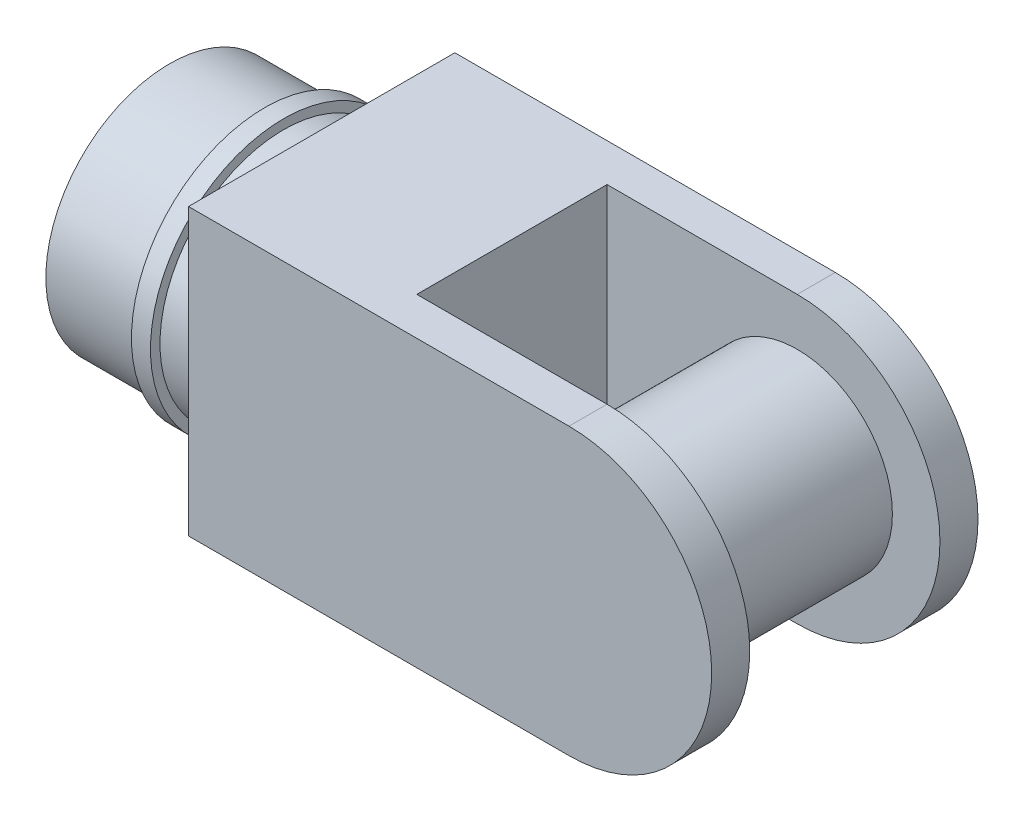
ISO-10303-21;
HEADER;
FILE_DESCRIPTION(('STEP AP214'),'2;1');
FILE_NAME('part.step','',(''),(''),'','','');
FILE_SCHEMA(('AUTOMOTIVE_DESIGN { 1 0 10303 214 1 1 1 1 }'));
ENDSEC;
DATA;
#1=APPLICATION_CONTEXT('core data for automotive mechanical design processes');
#2=APPLICATION_PROTOCOL_DEFINITION('international standard','automotive_design',2000,#1);
#3=PRODUCT_CONTEXT('',#1,'mechanical');
#4=PRODUCT('Part','Part','',(#3));
#5=PRODUCT_RELATED_PRODUCT_CATEGORY('part','',(#4));
#6=PRODUCT_DEFINITION_FORMATION('','',#4);
#7=PRODUCT_DEFINITION_CONTEXT('part definition',#1,'design');
#8=PRODUCT_DEFINITION('design','',#6,#7);
#9=PRODUCT_DEFINITION_SHAPE('','',#8);
#10=(LENGTH_UNIT() NAMED_UNIT(*) SI_UNIT(.MILLI.,.METRE.));
#11=(NAMED_UNIT(*) PLANE_ANGLE_UNIT() SI_UNIT($,.RADIAN.));
#12=(NAMED_UNIT(*) SI_UNIT($,.STERADIAN.) SOLID_ANGLE_UNIT());
#13=UNCERTAINTY_MEASURE_WITH_UNIT(LENGTH_MEASURE(1.E-05),#10,'distance_accuracy_value','');
#14=(GEOMETRIC_REPRESENTATION_CONTEXT(3) GLOBAL_UNCERTAINTY_ASSIGNED_CONTEXT((#13)) GLOBAL_UNIT_ASSIGNED_CONTEXT((#10,
#11,#12)) REPRESENTATION_CONTEXT('',''));
#15=CARTESIAN_POINT('',(0.,0.,0.));
#16=DIRECTION('',(0.,0.,1.));
#17=DIRECTION('',(1.,0.,0.));
#18=AXIS2_PLACEMENT_3D('',#15,#16,#17);
#19=CARTESIAN_POINT('',(240.,75.,-70.));
#20=DIRECTION('',(1.,0.,0.));
#21=DIRECTION('',(0.,0.,-1.));
#22=AXIS2_PLACEMENT_3D('',#19,#20,#21);
#23=PLANE('',#22);
#24=CARTESIAN_POINT('',(240.,0.,0.));
#25=DIRECTION('',(1.,0.,0.));
#26=DIRECTION('',(0.,0.,-1.));
#27=AXIS2_PLACEMENT_3D('',#24,#25,#26);
#28=CIRCLE('',#27,65.);
#29=CARTESIAN_POINT('',(240.,0.,-65.));
#30=VERTEX_POINT('',#29);
#31=EDGE_CURVE('E150',#30,#30,#28,.T.);
#32=ORIENTED_EDGE('',*,*,#31,.F.);
#33=EDGE_LOOP('',(#32));
#34=FACE_BOUND('',#33,.T.);
#35=ADVANCED_FACE('F40',(#34),#23,.F.);
#36=CARTESIAN_POINT('',(520.,0.,80.002));
#37=DIRECTION('',(0.,0.,-1.));
#38=DIRECTION('',(-1.,0.,0.));
#39=AXIS2_PLACEMENT_3D('',#36,#37,#38);
#40=CYLINDRICAL_SURFACE('',#39,50.);
#41=CARTESIAN_POINT('',(520.,0.,-50.));
#42=DIRECTION('',(0.,0.,1.));
#43=DIRECTION('',(1.,0.,0.));
#44=AXIS2_PLACEMENT_3D('',#41,#42,#43);
#45=CIRCLE('',#44,50.);
#46=CARTESIAN_POINT('',(570.,0.,-50.));
#47=VERTEX_POINT('',#46);
#48=EDGE_CURVE('E228',#47,#47,#45,.T.);
#49=ORIENTED_EDGE('',*,*,#48,.T.);
#50=EDGE_LOOP('',(#49));
#51=FACE_BOUND('',#50,.T.);
#52=CARTESIAN_POINT('',(520.,0.,50.));
#53=DIRECTION('',(0.,0.,1.));
#54=DIRECTION('',(1.,0.,0.));
#55=AXIS2_PLACEMENT_3D('',#52,#53,#54);
#56=CIRCLE('',#55,50.);
#57=CARTESIAN_POINT('',(570.,0.,50.));
#58=VERTEX_POINT('',#57);
#59=EDGE_CURVE('E11',#58,#58,#56,.F.);
#60=ORIENTED_EDGE('',*,*,#59,.T.);
#61=EDGE_LOOP('',(#60));
#62=FACE_BOUND('',#61,.T.);
#63=ADVANCED_FACE('F164',(#51,#62),#40,.T.);
#64=CARTESIAN_POINT('',(520.,0.,70.));
#65=DIRECTION('',(0.,0.,-1.));
#66=DIRECTION('',(-1.,0.,0.));
#67=AXIS2_PLACEMENT_3D('',#64,#65,#66);
#68=CYLINDRICAL_SURFACE('',#67,75.);
#69=DIRECTION('',(0.,0.,-1.));
#70=VECTOR('',#69,1.);
#71=CARTESIAN_POINT('',(520.,-75.,70.));
#72=LINE('',#71,#70);
#73=CARTESIAN_POINT('',(520.,-75.,70.));
#74=VERTEX_POINT('',#73);
#75=CARTESIAN_POINT('',(520.,-75.,50.));
#76=VERTEX_POINT('',#75);
#77=EDGE_CURVE('E256',#74,#76,#72,.T.);
#78=ORIENTED_EDGE('',*,*,#77,.T.);
#79=CARTESIAN_POINT('',(520.,0.,50.));
#80=DIRECTION('',(0.,0.,1.));
#81=DIRECTION('',(1.,0.,0.));
#82=AXIS2_PLACEMENT_3D('',#79,#80,#81);
#83=CIRCLE('',#82,75.);
#84=CARTESIAN_POINT('',(520.,75.,50.));
#85=VERTEX_POINT('',#84);
#86=EDGE_CURVE('E54',#76,#85,#83,.T.);
#87=ORIENTED_EDGE('',*,*,#86,.T.);
#88=DIRECTION('',(0.,0.,-1.));
#89=VECTOR('',#88,1.);
#90=CARTESIAN_POINT('',(520.,75.,70.));
#91=LINE('',#90,#89);
#92=CARTESIAN_POINT('',(520.,75.,70.));
#93=VERTEX_POINT('',#92);
#94=EDGE_CURVE('E136',#93,#85,#91,.T.);
#95=ORIENTED_EDGE('',*,*,#94,.F.);
#96=CARTESIAN_POINT('',(520.,0.,70.));
#97=DIRECTION('',(0.,0.,1.));
#98=DIRECTION('',(1.,0.,0.));
#99=AXIS2_PLACEMENT_3D('',#96,#97,#98);
#100=CIRCLE('',#99,75.);
#101=EDGE_CURVE('E243',#74,#93,#100,.T.);
#102=ORIENTED_EDGE('',*,*,#101,.F.);
#103=EDGE_LOOP('',(#78,#87,#95,#102));
#104=FACE_BOUND('',#103,.T.);
#105=ADVANCED_FACE('F168',(#104),#68,.T.);
#106=CARTESIAN_POINT('',(520.,0.,50.));
#107=DIRECTION('',(0.,0.,1.));
#108=DIRECTION('',(1.,0.,0.));
#109=AXIS2_PLACEMENT_3D('',#106,#107,#108);
#110=PLANE('',#109);
#111=ORIENTED_EDGE('',*,*,#59,.F.);
#112=EDGE_LOOP('',(#111));
#113=FACE_BOUND('',#112,.T.);
#114=ORIENTED_EDGE('',*,*,#86,.F.);
#115=DIRECTION('',(1.,0.,0.));
#116=VECTOR('',#115,1.);
#117=CARTESIAN_POINT('',(420.,-75.,50.));
#118=LINE('',#117,#116);
#119=CARTESIAN_POINT('',(420.,-75.,50.));
#120=VERTEX_POINT('',#119);
#121=EDGE_CURVE('E124',#120,#76,#118,.T.);
#122=ORIENTED_EDGE('',*,*,#121,.F.);
#123=DIRECTION('',(0.,-1.,0.));
#124=VECTOR('',#123,1.);
#125=CARTESIAN_POINT('',(420.,75.,50.));
#126=LINE('',#125,#124);
#127=CARTESIAN_POINT('',(420.,75.,50.));
#128=VERTEX_POINT('',#127);
#129=EDGE_CURVE('E236',#128,#120,#126,.T.);
#130=ORIENTED_EDGE('',*,*,#129,.F.);
#131=DIRECTION('',(-1.,0.,0.));
#132=VECTOR('',#131,1.);
#133=CARTESIAN_POINT('',(520.,75.,50.));
#134=LINE('',#133,#132);
#135=EDGE_CURVE('E230',#85,#128,#134,.T.);
#136=ORIENTED_EDGE('',*,*,#135,.F.);
#137=EDGE_LOOP('',(#114,#122,#130,#136));
#138=FACE_BOUND('',#137,.T.);
#139=ADVANCED_FACE('F196',(#113,#138),#110,.F.);
#140=CARTESIAN_POINT('',(420.,75.,-50.));
#141=DIRECTION('',(-1.,0.,0.));
#142=DIRECTION('',(0.,-1.,0.));
#143=AXIS2_PLACEMENT_3D('',#140,#141,#142);
#144=PLANE('',#143);
#145=ORIENTED_EDGE('',*,*,#129,.T.);
#146=DIRECTION('',(0.,0.,1.));
#147=VECTOR('',#146,1.);
#148=CARTESIAN_POINT('',(420.,-75.,-50.));
#149=LINE('',#148,#147);
#150=CARTESIAN_POINT('',(420.,-75.,-50.));
#151=VERTEX_POINT('',#150);
#152=EDGE_CURVE('E239',#151,#120,#149,.T.);
#153=ORIENTED_EDGE('',*,*,#152,.F.);
#154=DIRECTION('',(0.,-1.,0.));
#155=VECTOR('',#154,1.);
#156=CARTESIAN_POINT('',(420.,75.,-50.));
#157=LINE('',#156,#155);
#158=CARTESIAN_POINT('',(420.,75.,-50.));
#159=VERTEX_POINT('',#158);
#160=EDGE_CURVE('E131',#159,#151,#157,.T.);
#161=ORIENTED_EDGE('',*,*,#160,.F.);
#162=DIRECTION('',(0.,0.,1.));
#163=VECTOR('',#162,1.);
#164=CARTESIAN_POINT('',(420.,75.,-50.));
#165=LINE('',#164,#163);
#166=EDGE_CURVE('E130',#159,#128,#165,.T.);
#167=ORIENTED_EDGE('',*,*,#166,.T.);
#168=EDGE_LOOP('',(#145,#153,#161,#167));
#169=FACE_BOUND('',#168,.T.);
#170=ADVANCED_FACE('F214',(#169),#144,.F.);
#171=CARTESIAN_POINT('',(520.,0.,-50.));
#172=DIRECTION('',(0.,0.,1.));
#173=DIRECTION('',(1.,0.,0.));
#174=AXIS2_PLACEMENT_3D('',#171,#172,#173);
#175=PLANE('',#174);
#176=ORIENTED_EDGE('',*,*,#48,.F.);
#177=EDGE_LOOP('',(#176));
#178=FACE_BOUND('',#177,.T.);
#179=CARTESIAN_POINT('',(520.,0.,-50.));
#180=DIRECTION('',(0.,0.,1.));
#181=DIRECTION('',(1.,0.,0.));
#182=AXIS2_PLACEMENT_3D('',#179,#180,#181);
#183=CIRCLE('',#182,75.);
#184=CARTESIAN_POINT('',(520.,-75.,-50.));
#185=VERTEX_POINT('',#184);
#186=CARTESIAN_POINT('',(520.,75.,-50.));
#187=VERTEX_POINT('',#186);
#188=EDGE_CURVE('E115',#185,#187,#183,.T.);
#189=ORIENTED_EDGE('',*,*,#188,.T.);
#190=DIRECTION('',(-1.,0.,0.));
#191=VECTOR('',#190,1.);
#192=CARTESIAN_POINT('',(520.,75.,-50.));
#193=LINE('',#192,#191);
#194=EDGE_CURVE('E119',#187,#159,#193,.T.);
#195=ORIENTED_EDGE('',*,*,#194,.T.);
#196=ORIENTED_EDGE('',*,*,#160,.T.);
#197=DIRECTION('',(1.,0.,0.));
#198=VECTOR('',#197,1.);
#199=CARTESIAN_POINT('',(420.,-75.,-50.));
#200=LINE('',#199,#198);
#201=EDGE_CURVE('E122',#151,#185,#200,.T.);
#202=ORIENTED_EDGE('',*,*,#201,.T.);
#203=EDGE_LOOP('',(#189,#195,#196,#202));
#204=FACE_BOUND('',#203,.T.);
#205=ADVANCED_FACE('F117',(#178,#204),#175,.T.);
#206=ORIENTED_EDGE('',*,*,#188,.F.);
#207=CARTESIAN_POINT('',(520.,-75.,-70.));
#208=VERTEX_POINT('',#207);
#209=EDGE_CURVE('E85',#185,#208,#72,.T.);
#210=ORIENTED_EDGE('',*,*,#209,.T.);
#211=CARTESIAN_POINT('',(520.,0.,-70.));
#212=DIRECTION('',(0.,0.,1.));
#213=DIRECTION('',(1.,0.,0.));
#214=AXIS2_PLACEMENT_3D('',#211,#212,#213);
#215=CIRCLE('',#214,75.);
#216=CARTESIAN_POINT('',(520.,75.,-70.));
#217=VERTEX_POINT('',#216);
#218=EDGE_CURVE('E135',#208,#217,#215,.T.);
#219=ORIENTED_EDGE('',*,*,#218,.T.);
#220=EDGE_CURVE('E127',#187,#217,#91,.T.);
#221=ORIENTED_EDGE('',*,*,#220,.F.);
#222=EDGE_LOOP('',(#206,#210,#219,#221));
#223=FACE_BOUND('',#222,.T.);
#224=ADVANCED_FACE('F133',(#223),#68,.T.);
#225=CARTESIAN_POINT('',(520.,75.,70.));
#226=DIRECTION('',(0.,-1.,0.));
#227=DIRECTION('',(1.,0.,0.));
#228=AXIS2_PLACEMENT_3D('',#225,#226,#227);
#229=PLANE('',#228);
#230=ORIENTED_EDGE('',*,*,#194,.F.);
#231=ORIENTED_EDGE('',*,*,#220,.T.);
#232=DIRECTION('',(-1.,0.,0.));
#233=VECTOR('',#232,1.);
#234=CARTESIAN_POINT('',(520.,75.,-70.));
#235=LINE('',#234,#233);
#236=CARTESIAN_POINT('',(320.,75.,-70.));
#237=VERTEX_POINT('',#236);
#238=EDGE_CURVE('E251',#217,#237,#235,.T.);
#239=ORIENTED_EDGE('',*,*,#238,.T.);
#240=DIRECTION('',(0.,0.,-1.));
#241=VECTOR('',#240,1.);
#242=CARTESIAN_POINT('',(320.,75.,70.));
#243=LINE('',#242,#241);
#244=CARTESIAN_POINT('',(320.,75.,70.));
#245=VERTEX_POINT('',#244);
#246=EDGE_CURVE('E137',#245,#237,#243,.T.);
#247=ORIENTED_EDGE('',*,*,#246,.F.);
#248=DIRECTION('',(-1.,0.,0.));
#249=VECTOR('',#248,1.);
#250=CARTESIAN_POINT('',(520.,75.,70.));
#251=LINE('',#250,#249);
#252=EDGE_CURVE('E93',#93,#245,#251,.T.);
#253=ORIENTED_EDGE('',*,*,#252,.F.);
#254=ORIENTED_EDGE('',*,*,#94,.T.);
#255=ORIENTED_EDGE('',*,*,#135,.T.);
#256=ORIENTED_EDGE('',*,*,#166,.F.);
#257=EDGE_LOOP('',(#230,#231,#239,#247,#253,#254,#255,#256));
#258=FACE_BOUND('',#257,.T.);
#259=ADVANCED_FACE('F126',(#258),#229,.F.);
#260=CARTESIAN_POINT('',(520.,0.,70.));
#261=DIRECTION('',(0.,0.,1.));
#262=DIRECTION('',(1.,0.,0.));
#263=AXIS2_PLACEMENT_3D('',#260,#261,#262);
#264=PLANE('',#263);
#265=ORIENTED_EDGE('',*,*,#101,.T.);
#266=ORIENTED_EDGE('',*,*,#252,.T.);
#267=DIRECTION('',(0.,-1.,0.));
#268=VECTOR('',#267,1.);
#269=CARTESIAN_POINT('',(320.,75.,70.));
#270=LINE('',#269,#268);
#271=CARTESIAN_POINT('',(320.,-75.,70.));
#272=VERTEX_POINT('',#271);
#273=EDGE_CURVE('E247',#245,#272,#270,.T.);
#274=ORIENTED_EDGE('',*,*,#273,.T.);
#275=DIRECTION('',(1.,0.,0.));
#276=VECTOR('',#275,1.);
#277=CARTESIAN_POINT('',(320.,-75.,70.));
#278=LINE('',#277,#276);
#279=EDGE_CURVE('E63',#272,#74,#278,.T.);
#280=ORIENTED_EDGE('',*,*,#279,.T.);
#281=EDGE_LOOP('',(#265,#266,#274,#280));
#282=FACE_BOUND('',#281,.T.);
#283=ADVANCED_FACE('F200',(#282),#264,.T.);
#284=CARTESIAN_POINT('',(320.,-75.,70.));
#285=DIRECTION('',(0.,1.,0.));
#286=DIRECTION('',(-1.,0.,0.));
#287=AXIS2_PLACEMENT_3D('',#284,#285,#286);
#288=PLANE('',#287);
#289=ORIENTED_EDGE('',*,*,#201,.F.);
#290=ORIENTED_EDGE('',*,*,#152,.T.);
#291=ORIENTED_EDGE('',*,*,#121,.T.);
#292=ORIENTED_EDGE('',*,*,#77,.F.);
#293=ORIENTED_EDGE('',*,*,#279,.F.);
#294=DIRECTION('',(0.,0.,-1.));
#295=VECTOR('',#294,1.);
#296=CARTESIAN_POINT('',(320.,-75.,70.));
#297=LINE('',#296,#295);
#298=CARTESIAN_POINT('',(320.,-75.,-70.));
#299=VERTEX_POINT('',#298);
#300=EDGE_CURVE('E141',#272,#299,#297,.T.);
#301=ORIENTED_EDGE('',*,*,#300,.T.);
#302=DIRECTION('',(1.,0.,0.));
#303=VECTOR('',#302,1.);
#304=CARTESIAN_POINT('',(320.,-75.,-70.));
#305=LINE('',#304,#303);
#306=EDGE_CURVE('E245',#299,#208,#305,.T.);
#307=ORIENTED_EDGE('',*,*,#306,.T.);
#308=ORIENTED_EDGE('',*,*,#209,.F.);
#309=EDGE_LOOP('',(#289,#290,#291,#292,#293,#301,#307,#308));
#310=FACE_BOUND('',#309,.T.);
#311=ADVANCED_FACE('F205',(#310),#288,.F.);
#312=CARTESIAN_POINT('',(520.,0.,-70.));
#313=DIRECTION('',(0.,0.,1.));
#314=DIRECTION('',(1.,0.,0.));
#315=AXIS2_PLACEMENT_3D('',#312,#313,#314);
#316=PLANE('',#315);
#317=ORIENTED_EDGE('',*,*,#218,.F.);
#318=ORIENTED_EDGE('',*,*,#306,.F.);
#319=DIRECTION('',(0.,-1.,0.));
#320=VECTOR('',#319,1.);
#321=CARTESIAN_POINT('',(320.,75.,-70.));
#322=LINE('',#321,#320);
#323=EDGE_CURVE('E253',#237,#299,#322,.T.);
#324=ORIENTED_EDGE('',*,*,#323,.F.);
#325=ORIENTED_EDGE('',*,*,#238,.F.);
#326=EDGE_LOOP('',(#317,#318,#324,#325));
#327=FACE_BOUND('',#326,.T.);
#328=ADVANCED_FACE('F203',(#327),#316,.F.);
#329=CARTESIAN_POINT('',(320.,75.,70.));
#330=DIRECTION('',(1.,0.,0.));
#331=DIRECTION('',(0.,1.,0.));
#332=AXIS2_PLACEMENT_3D('',#329,#330,#331);
#333=PLANE('',#332);
#334=CARTESIAN_POINT('',(320.,0.,0.));
#335=DIRECTION('',(1.,0.,0.));
#336=DIRECTION('',(0.,0.,-1.));
#337=AXIS2_PLACEMENT_3D('',#334,#335,#336);
#338=CIRCLE('',#337,65.);
#339=CARTESIAN_POINT('',(320.,0.,-65.));
#340=VERTEX_POINT('',#339);
#341=EDGE_CURVE('E139',#340,#340,#338,.T.);
#342=ORIENTED_EDGE('',*,*,#341,.T.);
#343=EDGE_LOOP('',(#342));
#344=FACE_BOUND('',#343,.T.);
#345=ORIENTED_EDGE('',*,*,#323,.T.);
#346=ORIENTED_EDGE('',*,*,#300,.F.);
#347=ORIENTED_EDGE('',*,*,#273,.F.);
#348=ORIENTED_EDGE('',*,*,#246,.T.);
#349=EDGE_LOOP('',(#345,#346,#347,#348));
#350=FACE_BOUND('',#349,.T.);
#351=ADVANCED_FACE('F192',(#344,#350),#333,.F.);
#352=CARTESIAN_POINT('',(320.,0.,0.));
#353=DIRECTION('',(-1.,0.,0.));
#354=DIRECTION('',(0.,0.,1.));
#355=AXIS2_PLACEMENT_3D('',#352,#353,#354);
#356=CYLINDRICAL_SURFACE('',#355,65.);
#357=ORIENTED_EDGE('',*,*,#341,.F.);
#358=EDGE_LOOP('',(#357));
#359=FACE_BOUND('',#358,.T.);
#360=CARTESIAN_POINT('',(300.,0.,0.));
#361=DIRECTION('',(1.,0.,0.));
#362=DIRECTION('',(0.,0.,-1.));
#363=AXIS2_PLACEMENT_3D('',#360,#361,#362);
#364=CIRCLE('',#363,65.);
#365=CARTESIAN_POINT('',(300.,0.,-65.));
#366=VERTEX_POINT('',#365);
#367=EDGE_CURVE('E47',#366,#366,#364,.T.);
#368=ORIENTED_EDGE('',*,*,#367,.T.);
#369=EDGE_LOOP('',(#368));
#370=FACE_BOUND('',#369,.T.);
#371=ADVANCED_FACE('F188',(#359,#370),#356,.T.);
#372=CARTESIAN_POINT('',(300.,0.,0.));
#373=DIRECTION('',(1.,0.,0.));
#374=DIRECTION('',(0.,0.,-1.));
#375=AXIS2_PLACEMENT_3D('',#372,#373,#374);
#376=PLANE('',#375);
#377=ORIENTED_EDGE('',*,*,#367,.F.);
#378=EDGE_LOOP('',(#377));
#379=FACE_BOUND('',#378,.T.);
#380=CARTESIAN_POINT('',(300.,0.,0.));
#381=DIRECTION('',(1.,0.,0.));
#382=DIRECTION('',(0.,0.,-1.));
#383=AXIS2_PLACEMENT_3D('',#380,#381,#382);
#384=CIRCLE('',#383,70.);
#385=CARTESIAN_POINT('',(300.,0.,-70.));
#386=VERTEX_POINT('',#385);
#387=EDGE_CURVE('E151',#386,#386,#384,.T.);
#388=ORIENTED_EDGE('',*,*,#387,.T.);
#389=EDGE_LOOP('',(#388));
#390=FACE_BOUND('',#389,.T.);
#391=ADVANCED_FACE('F183',(#379,#390),#376,.T.);
#392=CARTESIAN_POINT('',(300.,0.,0.));
#393=DIRECTION('',(-1.,0.,0.));
#394=DIRECTION('',(0.,0.,1.));
#395=AXIS2_PLACEMENT_3D('',#392,#393,#394);
#396=CYLINDRICAL_SURFACE('',#395,70.);
#397=ORIENTED_EDGE('',*,*,#387,.F.);
#398=EDGE_LOOP('',(#397));
#399=FACE_BOUND('',#398,.T.);
#400=CARTESIAN_POINT('',(290.,0.,0.));
#401=DIRECTION('',(1.,0.,0.));
#402=DIRECTION('',(0.,0.,-1.));
#403=AXIS2_PLACEMENT_3D('',#400,#401,#402);
#404=CIRCLE('',#403,70.);
#405=CARTESIAN_POINT('',(290.,0.,-70.));
#406=VERTEX_POINT('',#405);
#407=EDGE_CURVE('E147',#406,#406,#404,.T.);
#408=ORIENTED_EDGE('',*,*,#407,.T.);
#409=EDGE_LOOP('',(#408));
#410=FACE_BOUND('',#409,.T.);
#411=ADVANCED_FACE('F177',(#399,#410),#396,.T.);
#412=CARTESIAN_POINT('',(290.,0.,0.));
#413=DIRECTION('',(1.,0.,0.));
#414=DIRECTION('',(0.,0.,-1.));
#415=AXIS2_PLACEMENT_3D('',#412,#413,#414);
#416=PLANE('',#415);
#417=CARTESIAN_POINT('',(290.,0.,0.));
#418=DIRECTION('',(1.,0.,0.));
#419=DIRECTION('',(0.,0.,-1.));
#420=AXIS2_PLACEMENT_3D('',#417,#418,#419);
#421=CIRCLE('',#420,65.);
#422=CARTESIAN_POINT('',(290.,0.,-65.));
#423=VERTEX_POINT('',#422);
#424=EDGE_CURVE('E154',#423,#423,#421,.T.);
#425=ORIENTED_EDGE('',*,*,#424,.T.);
#426=EDGE_LOOP('',(#425));
#427=FACE_BOUND('',#426,.T.);
#428=ORIENTED_EDGE('',*,*,#407,.F.);
#429=EDGE_LOOP('',(#428));
#430=FACE_BOUND('',#429,.T.);
#431=ADVANCED_FACE('F172',(#427,#430),#416,.F.);
#432=CARTESIAN_POINT('',(290.,0.,0.));
#433=DIRECTION('',(-1.,0.,0.));
#434=DIRECTION('',(0.,0.,1.));
#435=AXIS2_PLACEMENT_3D('',#432,#433,#434);
#436=CYLINDRICAL_SURFACE('',#435,65.);
#437=ORIENTED_EDGE('',*,*,#424,.F.);
#438=EDGE_LOOP('',(#437));
#439=FACE_BOUND('',#438,.T.);
#440=ORIENTED_EDGE('',*,*,#31,.T.);
#441=EDGE_LOOP('',(#440));
#442=FACE_BOUND('',#441,.T.);
#443=ADVANCED_FACE('F161',(#439,#442),#436,.T.);
#444=CLOSED_SHELL('',(#35,#63,#105,#139,#170,#205,#224,#259,#283,#311,#328,#351,#371,#391,#411,
#431,#443));
#445=MANIFOLD_SOLID_BREP('B2',#444);
#446=ADVANCED_BREP_SHAPE_REPRESENTATION('',(#18,#445),#14);
#447=SHAPE_DEFINITION_REPRESENTATION(#9,#446);
ENDSEC;
END-ISO-10303-21;
